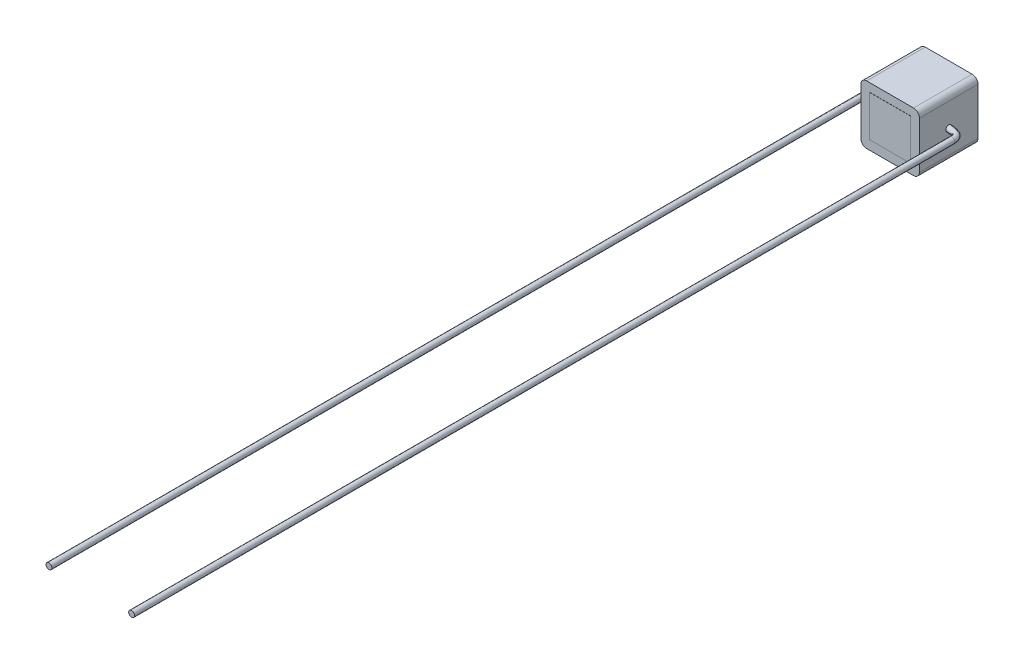
ISO-10303-21;
HEADER;
FILE_DESCRIPTION(('STEP AP214'),'2;1');
FILE_NAME('part.step','',(''),(''),'','','');
FILE_SCHEMA(('AUTOMOTIVE_DESIGN { 1 0 10303 214 1 1 1 1 }'));
ENDSEC;
DATA;
#1=APPLICATION_CONTEXT('core data for automotive mechanical design processes');
#2=APPLICATION_PROTOCOL_DEFINITION('international standard','automotive_design',2000,#1);
#3=PRODUCT_CONTEXT('',#1,'mechanical');
#4=PRODUCT('Part','Part','',(#3));
#5=PRODUCT_RELATED_PRODUCT_CATEGORY('part','',(#4));
#6=PRODUCT_DEFINITION_FORMATION('','',#4);
#7=PRODUCT_DEFINITION_CONTEXT('part definition',#1,'design');
#8=PRODUCT_DEFINITION('design','',#6,#7);
#9=PRODUCT_DEFINITION_SHAPE('','',#8);
#10=(LENGTH_UNIT() NAMED_UNIT(*) SI_UNIT(.MILLI.,.METRE.));
#11=(NAMED_UNIT(*) PLANE_ANGLE_UNIT() SI_UNIT($,.RADIAN.));
#12=(NAMED_UNIT(*) SI_UNIT($,.STERADIAN.) SOLID_ANGLE_UNIT());
#13=UNCERTAINTY_MEASURE_WITH_UNIT(LENGTH_MEASURE(1.E-05),#10,'distance_accuracy_value','');
#14=(GEOMETRIC_REPRESENTATION_CONTEXT(3) GLOBAL_UNCERTAINTY_ASSIGNED_CONTEXT((#13)) GLOBAL_UNIT_ASSIGNED_CONTEXT((#10,
#11,#12)) REPRESENTATION_CONTEXT('',''));
#15=CARTESIAN_POINT('',(0.,0.,0.));
#16=DIRECTION('',(0.,0.,1.));
#17=DIRECTION('',(1.,0.,0.));
#18=AXIS2_PLACEMENT_3D('',#15,#16,#17);
#19=CARTESIAN_POINT('',(-2.5,5.,-2.5));
#20=DIRECTION('',(1.,0.,0.));
#21=DIRECTION('',(0.,0.,-1.));
#22=AXIS2_PLACEMENT_3D('',#19,#20,#21);
#23=PLANE('',#22);
#24=DIRECTION('',(0.,-1.,0.));
#25=VECTOR('',#24,1.);
#26=CARTESIAN_POINT('',(-2.5,5.,2.5));
#27=LINE('',#26,#25);
#28=CARTESIAN_POINT('',(-2.5,4.5,2.5));
#29=VERTEX_POINT('',#28);
#30=CARTESIAN_POINT('',(-2.5,0.5,2.5));
#31=VERTEX_POINT('',#30);
#32=EDGE_CURVE('E901',#29,#31,#27,.T.);
#33=ORIENTED_EDGE('',*,*,#32,.F.);
#34=DIRECTION('',(0.,0.,1.));
#35=VECTOR('',#34,1.);
#36=CARTESIAN_POINT('',(-2.5,4.5,-2.5));
#37=LINE('',#36,#35);
#38=CARTESIAN_POINT('',(-2.5,4.5,-2.5));
#39=VERTEX_POINT('',#38);
#40=EDGE_CURVE('E15',#29,#39,#37,.F.);
#41=ORIENTED_EDGE('',*,*,#40,.T.);
#42=DIRECTION('',(0.,-1.,0.));
#43=VECTOR('',#42,1.);
#44=CARTESIAN_POINT('',(-2.5,5.,-2.5));
#45=LINE('',#44,#43);
#46=CARTESIAN_POINT('',(-2.5,0.5,-2.5));
#47=VERTEX_POINT('',#46);
#48=EDGE_CURVE('E888',#39,#47,#45,.T.);
#49=ORIENTED_EDGE('',*,*,#48,.T.);
#50=DIRECTION('',(0.,0.,1.));
#51=VECTOR('',#50,1.);
#52=CARTESIAN_POINT('',(-2.5,0.5,-2.5));
#53=LINE('',#52,#51);
#54=EDGE_CURVE('E655',#47,#31,#53,.T.);
#55=ORIENTED_EDGE('',*,*,#54,.T.);
#56=EDGE_LOOP('',(#33,#41,#49,#55));
#57=FACE_BOUND('',#56,.T.);
#58=CARTESIAN_POINT('',(-2.5,2.5,0.));
#59=DIRECTION('',(1.,0.,0.));
#60=DIRECTION('',(0.,0.,-1.));
#61=AXIS2_PLACEMENT_3D('',#58,#59,#60);
#62=CIRCLE('',#61,0.25);
#63=CARTESIAN_POINT('',(-2.5,2.5,-0.25));
#64=VERTEX_POINT('',#63);
#65=EDGE_CURVE('E904',#64,#64,#62,.F.);
#66=ORIENTED_EDGE('',*,*,#65,.F.);
#67=EDGE_LOOP('',(#66));
#68=FACE_BOUND('',#67,.T.);
#69=ADVANCED_FACE('F647',(#57,#68),#23,.F.);
#70=CARTESIAN_POINT('',(-2.5,5.,2.5));
#71=DIRECTION('',(0.,0.,-1.));
#72=DIRECTION('',(-1.,0.,0.));
#73=AXIS2_PLACEMENT_3D('',#70,#71,#72);
#74=PLANE('',#73);
#75=DIRECTION('',(1.,0.,0.));
#76=VECTOR('',#75,1.);
#77=CARTESIAN_POINT('',(-1.75,0.788215746263165,2.5));
#78=LINE('',#77,#76);
#79=CARTESIAN_POINT('',(-1.75,0.788215746263165,2.5));
#80=VERTEX_POINT('',#79);
#81=CARTESIAN_POINT('',(1.75,0.788215746263166,2.5));
#82=VERTEX_POINT('',#81);
#83=EDGE_CURVE('E765',#80,#82,#78,.T.);
#84=ORIENTED_EDGE('',*,*,#83,.F.);
#85=DIRECTION('',(0.,-1.,0.));
#86=VECTOR('',#85,1.);
#87=CARTESIAN_POINT('',(-1.75,4.28821574626317,2.5));
#88=LINE('',#87,#86);
#89=CARTESIAN_POINT('',(-1.75,4.28821574626317,2.5));
#90=VERTEX_POINT('',#89);
#91=EDGE_CURVE('E797',#90,#80,#88,.T.);
#92=ORIENTED_EDGE('',*,*,#91,.F.);
#93=DIRECTION('',(-1.,0.,0.));
#94=VECTOR('',#93,1.);
#95=CARTESIAN_POINT('',(-1.75,4.28821574626317,2.5));
#96=LINE('',#95,#94);
#97=CARTESIAN_POINT('',(1.75,4.28821574626317,2.5));
#98=VERTEX_POINT('',#97);
#99=EDGE_CURVE('E793',#98,#90,#96,.T.);
#100=ORIENTED_EDGE('',*,*,#99,.F.);
#101=DIRECTION('',(0.,1.,0.));
#102=VECTOR('',#101,1.);
#103=CARTESIAN_POINT('',(1.75,4.28821574626317,2.5));
#104=LINE('',#103,#102);
#105=EDGE_CURVE('E662',#82,#98,#104,.T.);
#106=ORIENTED_EDGE('',*,*,#105,.F.);
#107=EDGE_LOOP('',(#84,#92,#100,#106));
#108=FACE_BOUND('',#107,.T.);
#109=DIRECTION('',(1.,0.,0.));
#110=VECTOR('',#109,1.);
#111=CARTESIAN_POINT('',(-2.5,0.,2.5));
#112=LINE('',#111,#110);
#113=CARTESIAN_POINT('',(-2.,0.,2.5));
#114=VERTEX_POINT('',#113);
#115=CARTESIAN_POINT('',(2.,0.,2.5));
#116=VERTEX_POINT('',#115);
#117=EDGE_CURVE('E880',#114,#116,#112,.T.);
#118=ORIENTED_EDGE('',*,*,#117,.T.);
#119=CARTESIAN_POINT('',(2.,0.5,2.5));
#120=DIRECTION('',(0.,0.,-1.));
#121=DIRECTION('',(-1.,0.,0.));
#122=AXIS2_PLACEMENT_3D('',#119,#120,#121);
#123=CIRCLE('',#122,0.5);
#124=CARTESIAN_POINT('',(2.5,0.5,2.5));
#125=VERTEX_POINT('',#124);
#126=EDGE_CURVE('E930',#116,#125,#123,.F.);
#127=ORIENTED_EDGE('',*,*,#126,.T.);
#128=DIRECTION('',(0.,-1.,0.));
#129=VECTOR('',#128,1.);
#130=CARTESIAN_POINT('',(2.5,5.,2.5));
#131=LINE('',#130,#129);
#132=CARTESIAN_POINT('',(2.5,4.5,2.5));
#133=VERTEX_POINT('',#132);
#134=EDGE_CURVE('E898',#133,#125,#131,.T.);
#135=ORIENTED_EDGE('',*,*,#134,.F.);
#136=CARTESIAN_POINT('',(2.,4.5,2.5));
#137=DIRECTION('',(0.,0.,-1.));
#138=DIRECTION('',(-1.,0.,0.));
#139=AXIS2_PLACEMENT_3D('',#136,#137,#138);
#140=CIRCLE('',#139,0.5);
#141=CARTESIAN_POINT('',(2.,5.,2.5));
#142=VERTEX_POINT('',#141);
#143=EDGE_CURVE('E928',#133,#142,#140,.F.);
#144=ORIENTED_EDGE('',*,*,#143,.T.);
#145=DIRECTION('',(1.,0.,0.));
#146=VECTOR('',#145,1.);
#147=CARTESIAN_POINT('',(-2.5,5.,2.5));
#148=LINE('',#147,#146);
#149=CARTESIAN_POINT('',(-2.,5.,2.5));
#150=VERTEX_POINT('',#149);
#151=EDGE_CURVE('E881',#150,#142,#148,.T.);
#152=ORIENTED_EDGE('',*,*,#151,.F.);
#153=CARTESIAN_POINT('',(-2.,4.5,2.5));
#154=DIRECTION('',(0.,0.,-1.));
#155=DIRECTION('',(-1.,0.,0.));
#156=AXIS2_PLACEMENT_3D('',#153,#154,#155);
#157=CIRCLE('',#156,0.5);
#158=EDGE_CURVE('E926',#150,#29,#157,.F.);
#159=ORIENTED_EDGE('',*,*,#158,.T.);
#160=ORIENTED_EDGE('',*,*,#32,.T.);
#161=CARTESIAN_POINT('',(-2.,0.5,2.5));
#162=DIRECTION('',(0.,0.,-1.));
#163=DIRECTION('',(-1.,0.,0.));
#164=AXIS2_PLACEMENT_3D('',#161,#162,#163);
#165=CIRCLE('',#164,0.5);
#166=EDGE_CURVE('E924',#31,#114,#165,.F.);
#167=ORIENTED_EDGE('',*,*,#166,.T.);
#168=EDGE_LOOP('',(#118,#127,#135,#144,#152,#159,#160,#167));
#169=FACE_BOUND('',#168,.T.);
#170=ADVANCED_FACE('F947',(#108,#169),#74,.F.);
#171=CARTESIAN_POINT('',(2.5,5.,-2.5));
#172=DIRECTION('',(-1.,0.,0.));
#173=DIRECTION('',(0.,0.,1.));
#174=AXIS2_PLACEMENT_3D('',#171,#172,#173);
#175=PLANE('',#174);
#176=CARTESIAN_POINT('',(2.5,2.5,0.));
#177=DIRECTION('',(1.,0.,0.));
#178=DIRECTION('',(0.,0.,-1.));
#179=AXIS2_PLACEMENT_3D('',#176,#177,#178);
#180=CIRCLE('',#179,0.25);
#181=CARTESIAN_POINT('',(2.5,2.5,-0.25));
#182=VERTEX_POINT('',#181);
#183=EDGE_CURVE('E874',#182,#182,#180,.T.);
#184=ORIENTED_EDGE('',*,*,#183,.F.);
#185=EDGE_LOOP('',(#184));
#186=FACE_BOUND('',#185,.T.);
#187=ORIENTED_EDGE('',*,*,#134,.T.);
#188=DIRECTION('',(0.,0.,-1.));
#189=VECTOR('',#188,1.);
#190=CARTESIAN_POINT('',(2.5,0.5,-2.5));
#191=LINE('',#190,#189);
#192=CARTESIAN_POINT('',(2.5,0.5,-2.5));
#193=VERTEX_POINT('',#192);
#194=EDGE_CURVE('E909',#125,#193,#191,.T.);
#195=ORIENTED_EDGE('',*,*,#194,.T.);
#196=DIRECTION('',(0.,-1.,0.));
#197=VECTOR('',#196,1.);
#198=CARTESIAN_POINT('',(2.5,5.,-2.5));
#199=LINE('',#198,#197);
#200=CARTESIAN_POINT('',(2.5,4.5,-2.5));
#201=VERTEX_POINT('',#200);
#202=EDGE_CURVE('E895',#201,#193,#199,.T.);
#203=ORIENTED_EDGE('',*,*,#202,.F.);
#204=DIRECTION('',(0.,0.,-1.));
#205=VECTOR('',#204,1.);
#206=CARTESIAN_POINT('',(2.5,4.5,2.5));
#207=LINE('',#206,#205);
#208=EDGE_CURVE('E907',#201,#133,#207,.F.);
#209=ORIENTED_EDGE('',*,*,#208,.T.);
#210=EDGE_LOOP('',(#187,#195,#203,#209));
#211=FACE_BOUND('',#210,.T.);
#212=ADVANCED_FACE('F972',(#186,#211),#175,.F.);
#213=CARTESIAN_POINT('',(-2.5,5.,-2.5));
#214=DIRECTION('',(0.,0.,1.));
#215=DIRECTION('',(1.,0.,0.));
#216=AXIS2_PLACEMENT_3D('',#213,#214,#215);
#217=PLANE('',#216);
#218=DIRECTION('',(-1.,0.,0.));
#219=VECTOR('',#218,1.);
#220=CARTESIAN_POINT('',(1.75,0.75,-2.5));
#221=LINE('',#220,#219);
#222=CARTESIAN_POINT('',(1.75,0.75,-2.5));
#223=VERTEX_POINT('',#222);
#224=CARTESIAN_POINT('',(-1.75,0.75,-2.5));
#225=VERTEX_POINT('',#224);
#226=EDGE_CURVE('E813',#223,#225,#221,.T.);
#227=ORIENTED_EDGE('',*,*,#226,.F.);
#228=DIRECTION('',(0.,-1.,0.));
#229=VECTOR('',#228,1.);
#230=CARTESIAN_POINT('',(1.75,4.25,-2.5));
#231=LINE('',#230,#229);
#232=CARTESIAN_POINT('',(1.75,4.25,-2.5));
#233=VERTEX_POINT('',#232);
#234=EDGE_CURVE('E830',#233,#223,#231,.T.);
#235=ORIENTED_EDGE('',*,*,#234,.F.);
#236=DIRECTION('',(1.,0.,0.));
#237=VECTOR('',#236,1.);
#238=CARTESIAN_POINT('',(1.75,4.25,-2.5));
#239=LINE('',#238,#237);
#240=CARTESIAN_POINT('',(-1.75,4.25,-2.5));
#241=VERTEX_POINT('',#240);
#242=EDGE_CURVE('E826',#241,#233,#239,.T.);
#243=ORIENTED_EDGE('',*,*,#242,.F.);
#244=DIRECTION('',(0.,1.,0.));
#245=VECTOR('',#244,1.);
#246=CARTESIAN_POINT('',(-1.75,4.25,-2.5));
#247=LINE('',#246,#245);
#248=EDGE_CURVE('E670',#225,#241,#247,.T.);
#249=ORIENTED_EDGE('',*,*,#248,.F.);
#250=EDGE_LOOP('',(#227,#235,#243,#249));
#251=FACE_BOUND('',#250,.T.);
#252=ORIENTED_EDGE('',*,*,#202,.T.);
#253=CARTESIAN_POINT('',(2.,0.5,-2.5));
#254=DIRECTION('',(0.,0.,1.));
#255=DIRECTION('',(1.,0.,0.));
#256=AXIS2_PLACEMENT_3D('',#253,#254,#255);
#257=CIRCLE('',#256,0.5);
#258=CARTESIAN_POINT('',(2.,0.,-2.5));
#259=VERTEX_POINT('',#258);
#260=EDGE_CURVE('E918',#193,#259,#257,.F.);
#261=ORIENTED_EDGE('',*,*,#260,.T.);
#262=DIRECTION('',(-1.,0.,0.));
#263=VECTOR('',#262,1.);
#264=CARTESIAN_POINT('',(-2.5,0.,-2.5));
#265=LINE('',#264,#263);
#266=CARTESIAN_POINT('',(-2.,0.,-2.5));
#267=VERTEX_POINT('',#266);
#268=EDGE_CURVE('E885',#259,#267,#265,.T.);
#269=ORIENTED_EDGE('',*,*,#268,.T.);
#270=CARTESIAN_POINT('',(-2.,0.5,-2.5));
#271=DIRECTION('',(0.,0.,1.));
#272=DIRECTION('',(1.,0.,0.));
#273=AXIS2_PLACEMENT_3D('',#270,#271,#272);
#274=CIRCLE('',#273,0.5);
#275=EDGE_CURVE('E912',#267,#47,#274,.F.);
#276=ORIENTED_EDGE('',*,*,#275,.T.);
#277=ORIENTED_EDGE('',*,*,#48,.F.);
#278=CARTESIAN_POINT('',(-2.,4.5,-2.5));
#279=DIRECTION('',(0.,0.,1.));
#280=DIRECTION('',(1.,0.,0.));
#281=AXIS2_PLACEMENT_3D('',#278,#279,#280);
#282=CIRCLE('',#281,0.5);
#283=CARTESIAN_POINT('',(-2.,5.,-2.5));
#284=VERTEX_POINT('',#283);
#285=EDGE_CURVE('E914',#39,#284,#282,.F.);
#286=ORIENTED_EDGE('',*,*,#285,.T.);
#287=DIRECTION('',(-1.,0.,0.));
#288=VECTOR('',#287,1.);
#289=CARTESIAN_POINT('',(-2.5,5.,-2.5));
#290=LINE('',#289,#288);
#291=CARTESIAN_POINT('',(2.,5.,-2.5));
#292=VERTEX_POINT('',#291);
#293=EDGE_CURVE('E884',#292,#284,#290,.T.);
#294=ORIENTED_EDGE('',*,*,#293,.F.);
#295=CARTESIAN_POINT('',(2.,4.5,-2.5));
#296=DIRECTION('',(0.,0.,1.));
#297=DIRECTION('',(1.,0.,0.));
#298=AXIS2_PLACEMENT_3D('',#295,#296,#297);
#299=CIRCLE('',#298,0.5);
#300=EDGE_CURVE('E916',#292,#201,#299,.F.);
#301=ORIENTED_EDGE('',*,*,#300,.T.);
#302=EDGE_LOOP('',(#252,#261,#269,#276,#277,#286,#294,#301));
#303=FACE_BOUND('',#302,.T.);
#304=ADVANCED_FACE('F959',(#251,#303),#217,.F.);
#305=CARTESIAN_POINT('',(0.,5.,0.));
#306=DIRECTION('',(0.,1.,0.));
#307=DIRECTION('',(0.,0.,1.));
#308=AXIS2_PLACEMENT_3D('',#305,#306,#307);
#309=PLANE('',#308);
#310=ORIENTED_EDGE('',*,*,#151,.T.);
#311=DIRECTION('',(0.,0.,-1.));
#312=VECTOR('',#311,1.);
#313=CARTESIAN_POINT('',(2.,5.,-2.5));
#314=LINE('',#313,#312);
#315=EDGE_CURVE('E935',#142,#292,#314,.T.);
#316=ORIENTED_EDGE('',*,*,#315,.T.);
#317=ORIENTED_EDGE('',*,*,#293,.T.);
#318=DIRECTION('',(0.,0.,1.));
#319=VECTOR('',#318,1.);
#320=CARTESIAN_POINT('',(-2.,5.,2.5));
#321=LINE('',#320,#319);
#322=EDGE_CURVE('E932',#284,#150,#321,.T.);
#323=ORIENTED_EDGE('',*,*,#322,.T.);
#324=EDGE_LOOP('',(#310,#316,#317,#323));
#325=FACE_BOUND('',#324,.T.);
#326=ADVANCED_FACE('F955',(#325),#309,.T.);
#327=CARTESIAN_POINT('',(0.,0.,0.));
#328=DIRECTION('',(0.,1.,0.));
#329=DIRECTION('',(0.,0.,1.));
#330=AXIS2_PLACEMENT_3D('',#327,#328,#329);
#331=PLANE('',#330);
#332=ORIENTED_EDGE('',*,*,#268,.F.);
#333=DIRECTION('',(0.,0.,-1.));
#334=VECTOR('',#333,1.);
#335=CARTESIAN_POINT('',(2.,0.,0.));
#336=LINE('',#335,#334);
#337=EDGE_CURVE('E922',#259,#116,#336,.F.);
#338=ORIENTED_EDGE('',*,*,#337,.T.);
#339=ORIENTED_EDGE('',*,*,#117,.F.);
#340=DIRECTION('',(0.,0.,1.));
#341=VECTOR('',#340,1.);
#342=CARTESIAN_POINT('',(-2.,0.,0.));
#343=LINE('',#342,#341);
#344=EDGE_CURVE('E920',#114,#267,#343,.F.);
#345=ORIENTED_EDGE('',*,*,#344,.T.);
#346=EDGE_LOOP('',(#332,#338,#339,#345));
#347=FACE_BOUND('',#346,.T.);
#348=ADVANCED_FACE('F964',(#347),#331,.F.);
#349=CARTESIAN_POINT('',(2.5,2.5,-0.25));
#350=CARTESIAN_POINT('',(2.61032517128793,2.5,-0.2427171058597));
#351=CARTESIAN_POINT('',(2.81073621428615,2.5,-0.229487374206767));
#352=CARTESIAN_POINT('',(3.09944616648293,2.5,-0.176763451338567));
#353=CARTESIAN_POINT('',(3.30951725257793,2.5,-0.10391436418612));
#354=CARTESIAN_POINT('',(3.44547232801169,2.5,-0.0256418216858697));
#355=CARTESIAN_POINT('',(3.52920415005991,2.5,0.0412479904360616));
#356=CARTESIAN_POINT('',(3.59414239302131,2.5,0.111862987104917));
#357=CARTESIAN_POINT('',(3.66549095953961,2.5,0.21493192750837));
#358=CARTESIAN_POINT('',(3.72939373446737,2.5,0.362561949903834));
#359=CARTESIAN_POINT('',(3.76539215671446,2.5,0.553576564411401));
#360=CARTESIAN_POINT('',(3.77346652238264,2.5,0.679671891123966));
#361=CARTESIAN_POINT('',(3.77762525163319,2.5,0.744617714128271));
#362=CARTESIAN_POINT('',(2.5,3.,-0.25));
#363=CARTESIAN_POINT('',(2.61032517128793,3.,-0.2427171058597));
#364=CARTESIAN_POINT('',(2.81073621428615,3.,-0.229487374206767));
#365=CARTESIAN_POINT('',(3.09944616648293,3.,-0.176763451338567));
#366=CARTESIAN_POINT('',(3.30951725257793,3.,-0.10391436418612));
#367=CARTESIAN_POINT('',(3.44547232801169,3.,-0.02564182168587));
#368=CARTESIAN_POINT('',(3.52920415005991,3.,0.0412479904360618));
#369=CARTESIAN_POINT('',(3.59414239302131,3.,0.111862987104916));
#370=CARTESIAN_POINT('',(3.66549095953961,3.,0.21493192750837));
#371=CARTESIAN_POINT('',(3.72939373446737,3.,0.362561949903834));
#372=CARTESIAN_POINT('',(3.76539215671446,3.,0.553576564411401));
#373=CARTESIAN_POINT('',(3.77346652238264,3.,0.679671891123967));
#374=CARTESIAN_POINT('',(3.77762525163319,3.,0.744617714128271));
#375=CARTESIAN_POINT('',(2.5,3.,0.25));
#376=CARTESIAN_POINT('',(2.57516732177776,3.,0.25650810131158));
#377=CARTESIAN_POINT('',(2.71171242006315,3.,0.268330384083185));
#378=CARTESIAN_POINT('',(2.87076011421369,3.,0.296234243964267));
#379=CARTESIAN_POINT('',(2.97576764355255,3.,0.320256173702373));
#380=CARTESIAN_POINT('',(3.04984184625563,3.,0.341776369015182));
#381=CARTESIAN_POINT('',(3.10176362270132,3.,0.361152334233325));
#382=CARTESIAN_POINT('',(3.14770420651229,3.,0.385328779747776));
#383=CARTESIAN_POINT('',(3.20263101733343,3.,0.428119115980688));
#384=CARTESIAN_POINT('',(3.24945738104317,3.,0.507865780213265));
#385=CARTESIAN_POINT('',(3.26916749400132,3.,0.626995302872223));
#386=CARTESIAN_POINT('',(3.273641431928,3.,0.714239063316722));
#387=CARTESIAN_POINT('',(3.27594574873572,3.,0.759174256172635));
#388=CARTESIAN_POINT('',(2.5,2.5,0.25));
#389=CARTESIAN_POINT('',(2.57516732177776,2.5,0.25650810131158));
#390=CARTESIAN_POINT('',(2.71171242006315,2.5,0.268330384083185));
#391=CARTESIAN_POINT('',(2.87076011421369,2.5,0.296234243964268));
#392=CARTESIAN_POINT('',(2.97576764355255,2.5,0.320256173702373));
#393=CARTESIAN_POINT('',(3.04984184625562,2.5,0.341776369015182));
#394=CARTESIAN_POINT('',(3.10176362270132,2.5,0.361152334233325));
#395=CARTESIAN_POINT('',(3.14770420651229,2.5,0.385328779747775));
#396=CARTESIAN_POINT('',(3.20263101733343,2.5,0.428119115980688));
#397=CARTESIAN_POINT('',(3.24945738104317,2.5,0.507865780213265));
#398=CARTESIAN_POINT('',(3.26916749400132,2.5,0.626995302872223));
#399=CARTESIAN_POINT('',(3.273641431928,2.5,0.714239063316722));
#400=CARTESIAN_POINT('',(3.27594574873572,2.5,0.759174256172635));
#401=CARTESIAN_POINT('',(2.5,2.,0.25));
#402=CARTESIAN_POINT('',(2.57516732177776,2.,0.25650810131158));
#403=CARTESIAN_POINT('',(2.71171242006315,2.,0.268330384083185));
#404=CARTESIAN_POINT('',(2.87076011421369,2.,0.296234243964268));
#405=CARTESIAN_POINT('',(2.97576764355255,2.,0.320256173702373));
#406=CARTESIAN_POINT('',(3.04984184625563,2.,0.341776369015182));
#407=CARTESIAN_POINT('',(3.10176362270132,2.,0.361152334233325));
#408=CARTESIAN_POINT('',(3.14770420651229,2.,0.385328779747776));
#409=CARTESIAN_POINT('',(3.20263101733343,2.,0.428119115980688));
#410=CARTESIAN_POINT('',(3.24945738104317,2.,0.507865780213265));
#411=CARTESIAN_POINT('',(3.26916749400132,2.,0.626995302872223));
#412=CARTESIAN_POINT('',(3.273641431928,2.,0.714239063316722));
#413=CARTESIAN_POINT('',(3.27594574873572,2.,0.759174256172635));
#414=CARTESIAN_POINT('',(2.5,2.,-0.25));
#415=CARTESIAN_POINT('',(2.61032517128793,2.,-0.2427171058597));
#416=CARTESIAN_POINT('',(2.81073621428615,2.,-0.229487374206767));
#417=CARTESIAN_POINT('',(3.09944616648293,2.,-0.176763451338567));
#418=CARTESIAN_POINT('',(3.30951725257793,2.,-0.10391436418612));
#419=CARTESIAN_POINT('',(3.44547232801169,2.,-0.02564182168587));
#420=CARTESIAN_POINT('',(3.52920415005991,2.,0.0412479904360618));
#421=CARTESIAN_POINT('',(3.59414239302131,2.,0.111862987104916));
#422=CARTESIAN_POINT('',(3.66549095953961,2.,0.21493192750837));
#423=CARTESIAN_POINT('',(3.72939373446737,2.,0.362561949903834));
#424=CARTESIAN_POINT('',(3.76539215671446,2.,0.553576564411401));
#425=CARTESIAN_POINT('',(3.77346652238264,2.,0.679671891123967));
#426=CARTESIAN_POINT('',(3.77762525163319,2.,0.744617714128271));
#427=CARTESIAN_POINT('',(2.5,2.5,-0.25));
#428=CARTESIAN_POINT('',(2.61032517128793,2.5,-0.2427171058597));
#429=CARTESIAN_POINT('',(2.81073621428615,2.5,-0.229487374206767));
#430=CARTESIAN_POINT('',(3.09944616648293,2.5,-0.176763451338567));
#431=CARTESIAN_POINT('',(3.30951725257793,2.5,-0.10391436418612));
#432=CARTESIAN_POINT('',(3.44547232801169,2.5,-0.0256418216858697));
#433=CARTESIAN_POINT('',(3.52920415005991,2.5,0.0412479904360616));
#434=CARTESIAN_POINT('',(3.59414239302131,2.5,0.111862987104917));
#435=CARTESIAN_POINT('',(3.66549095953961,2.5,0.21493192750837));
#436=CARTESIAN_POINT('',(3.72939373446737,2.5,0.362561949903834));
#437=CARTESIAN_POINT('',(3.76539215671446,2.5,0.553576564411401));
#438=CARTESIAN_POINT('',(3.77346652238264,2.5,0.679671891123966));
#439=CARTESIAN_POINT('',(3.77762525163319,2.5,0.744617714128271));
#440=(BOUNDED_SURFACE() B_SPLINE_SURFACE(3,3,((#349,#350,#351,#352,#353,#354,#355,#356,#357,
#358,#359,#360,#361),(#362,#363,#364,#365,#366,#367,#368,#369,#370,#371,#372,#373,#374),(#375,
#376,#377,#378,#379,#380,#381,#382,#383,#384,#385,#386,#387),(#388,#389,#390,#391,#392,#393,
#394,#395,#396,#397,#398,#399,#400),(#401,#402,#403,#404,#405,#406,#407,#408,#409,#410,#411,
#412,#413),(#414,#415,#416,#417,#418,#419,#420,#421,#422,#423,#424,#425,#426),(#427,#428,#429,
#430,#431,#432,#433,#434,#435,#436,#437,#438,#439)),.UNSPECIFIED.,.T.,.F.,
.F.) B_SPLINE_SURFACE_WITH_KNOTS((4,3,4),(4,1,1,1,1,1,1,1,1,1,4),(0.,0.5,1.),(0.,
0.188467034881245,0.342359541257856,0.466752775749844,0.528710340586207,0.583960116245662,
0.633995598845497,0.680305858074827,0.783551341460871,0.888517388919216,1.),
.UNSPECIFIED.) GEOMETRIC_REPRESENTATION_ITEM() RATIONAL_B_SPLINE_SURFACE(((1.,1.,1.,1.,1.,1.,1.,
1.,1.,1.,1.,1.,1.),(0.333333333333333,0.333333333333333,0.333333333333333,0.333333333333333,
0.333333333333333,0.333333333333333,0.333333333333333,0.333333333333333,0.333333333333333,
0.333333333333333,0.333333333333333,0.333333333333333,0.333333333333333),(0.333333333333333,
0.333333333333333,0.333333333333333,0.333333333333333,0.333333333333333,0.333333333333333,
0.333333333333333,0.333333333333333,0.333333333333333,0.333333333333333,0.333333333333333,
0.333333333333333,0.333333333333333),(1.,1.,1.,1.,1.,1.,1.,1.,1.,1.,1.,1.,1.),
(0.333333333333333,0.333333333333333,0.333333333333333,0.333333333333333,0.333333333333333,
0.333333333333333,0.333333333333333,0.333333333333333,0.333333333333333,0.333333333333333,
0.333333333333333,0.333333333333333,0.333333333333333),(0.333333333333333,0.333333333333333,
0.333333333333333,0.333333333333333,0.333333333333333,0.333333333333333,0.333333333333333,
0.333333333333333,0.333333333333333,0.333333333333333,0.333333333333333,0.333333333333333,
0.333333333333333),(1.,1.,1.,1.,1.,1.,1.,1.,1.,1.,1.,1.,1.))) REPRESENTATION_ITEM('') SURFACE());
#441=CARTESIAN_POINT('',(3.77762525163319,2.5,0.744617714128271));
#442=CARTESIAN_POINT('',(3.77762525163319,2.,0.744617714128271));
#443=CARTESIAN_POINT('',(3.27594574873572,2.,0.759174256172635));
#444=CARTESIAN_POINT('',(3.27594574873572,2.5,0.759174256172635));
#445=CARTESIAN_POINT('',(3.27594574873572,3.,0.759174256172635));
#446=CARTESIAN_POINT('',(3.77762525163319,3.,0.744617714128271));
#447=CARTESIAN_POINT('',(3.77762525163319,2.5,0.744617714128271));
#448=(BOUNDED_CURVE() B_SPLINE_CURVE(3,(#441,#442,#443,#444,#445,#446,#447),.UNSPECIFIED.,.T.,
.F.) B_SPLINE_CURVE_WITH_KNOTS((4,3,4),(0.,0.5,1.),
.UNSPECIFIED.) CURVE() GEOMETRIC_REPRESENTATION_ITEM() RATIONAL_B_SPLINE_CURVE((1.,
0.333333333333333,0.333333333333333,1.,0.333333333333333,0.333333333333333,1.)) REPRESENTATION_ITEM(''));
#449=CARTESIAN_POINT('',(3.77762525163319,2.5,0.744617714128271));
#450=VERTEX_POINT('',#449);
#451=EDGE_CURVE('E858',#450,#450,#448,.T.);
#452=ORIENTED_EDGE('',*,*,#183,.T.);
#453=EDGE_LOOP('',(#452));
#454=FACE_BOUND('',#453,.T.);
#455=ORIENTED_EDGE('',*,*,#451,.T.);
#456=EDGE_LOOP('',(#455));
#457=FACE_BOUND('',#456,.T.);
#458=ADVANCED_FACE('F1001',(#454,#457),#440,.T.);
#459=CARTESIAN_POINT('',(3.27594574873573,2.5,70.7518959851505));
#460=DIRECTION('',(0.,0.,1.));
#461=DIRECTION('',(1.,0.,0.));
#462=AXIS2_PLACEMENT_3D('',#459,#460,#461);
#463=PLANE('',#462);
#464=CARTESIAN_POINT('',(3.7776252516332,2.5,70.7518959851505));
#465=CARTESIAN_POINT('',(3.7776252516332,2.,70.7518959851505));
#466=CARTESIAN_POINT('',(3.27594574873573,2.,70.7518959851505));
#467=CARTESIAN_POINT('',(3.27594574873573,2.5,70.7518959851505));
#468=CARTESIAN_POINT('',(3.27594574873573,3.,70.7518959851505));
#469=CARTESIAN_POINT('',(3.7776252516332,3.,70.7518959851505));
#470=CARTESIAN_POINT('',(3.7776252516332,2.5,70.7518959851505));
#471=(BOUNDED_CURVE() B_SPLINE_CURVE(3,(#464,#465,#466,#467,#468,#469,#470),.UNSPECIFIED.,.T.,
.F.) B_SPLINE_CURVE_WITH_KNOTS((4,3,4),(0.,0.5,1.),
.UNSPECIFIED.) CURVE() GEOMETRIC_REPRESENTATION_ITEM() RATIONAL_B_SPLINE_CURVE((1.,
0.333333333333333,0.333333333333333,1.,0.333333333333333,0.333333333333333,1.)) REPRESENTATION_ITEM(''));
#472=CARTESIAN_POINT('',(3.7776252516332,2.5,70.7518959851505));
#473=VERTEX_POINT('',#472);
#474=EDGE_CURVE('E866',#473,#473,#471,.F.);
#475=ORIENTED_EDGE('',*,*,#474,.T.);
#476=EDGE_LOOP('',(#475));
#477=FACE_BOUND('',#476,.T.);
#478=ADVANCED_FACE('F1008',(#477),#463,.T.);
#479=CARTESIAN_POINT('',(3.77762525163319,2.5,0.744617714128271));
#480=CARTESIAN_POINT('',(3.7776252516332,2.5,70.7518959851505));
#481=CARTESIAN_POINT('',(3.77762525163319,2.,0.744617714128271));
#482=CARTESIAN_POINT('',(3.7776252516332,2.,70.7518959851505));
#483=CARTESIAN_POINT('',(3.27594574873572,2.,0.759174256172635));
#484=CARTESIAN_POINT('',(3.27594574873573,2.,70.7518959851505));
#485=CARTESIAN_POINT('',(3.27594574873572,2.5,0.759174256172635));
#486=CARTESIAN_POINT('',(3.27594574873573,2.5,70.7518959851505));
#487=CARTESIAN_POINT('',(3.27594574873572,3.,0.759174256172635));
#488=CARTESIAN_POINT('',(3.27594574873573,3.,70.7518959851505));
#489=CARTESIAN_POINT('',(3.77762525163319,3.,0.744617714128271));
#490=CARTESIAN_POINT('',(3.7776252516332,3.,70.7518959851505));
#491=CARTESIAN_POINT('',(3.77762525163319,2.5,0.744617714128271));
#492=CARTESIAN_POINT('',(3.7776252516332,2.5,70.7518959851505));
#493=(BOUNDED_SURFACE() B_SPLINE_SURFACE(3,1,((#479,#480),(#481,#482),(#483,#484),(#485,#486),
(#487,#488),(#489,#490),(#491,#492)),.UNSPECIFIED.,.T.,.F.,.F.) B_SPLINE_SURFACE_WITH_KNOTS((4,
3,4),(2,2),(0.,0.5,1.),(0.,1.),
.UNSPECIFIED.) GEOMETRIC_REPRESENTATION_ITEM() RATIONAL_B_SPLINE_SURFACE(((1.,1.),
(0.333333333333333,0.333333333333333),(0.333333333333333,0.333333333333333),(1.,1.),
(0.333333333333333,0.333333333333333),(0.333333333333333,0.333333333333333),(1.,1.))) REPRESENTATION_ITEM('') SURFACE());
#494=ORIENTED_EDGE('',*,*,#451,.F.);
#495=EDGE_LOOP('',(#494));
#496=FACE_BOUND('',#495,.T.);
#497=ORIENTED_EDGE('',*,*,#474,.F.);
#498=EDGE_LOOP('',(#497));
#499=FACE_BOUND('',#498,.T.);
#500=ADVANCED_FACE('F1017',(#496,#499),#493,.F.);
#501=CARTESIAN_POINT('',(-2.5,2.5,-0.25));
#502=CARTESIAN_POINT('',(-2.61032517128793,2.5,-0.242717105859699));
#503=CARTESIAN_POINT('',(-2.81073621428615,2.5,-0.229487374206767));
#504=CARTESIAN_POINT('',(-3.09944616648293,2.5,-0.176763451338566));
#505=CARTESIAN_POINT('',(-3.30951725257793,2.5,-0.103914364186119));
#506=CARTESIAN_POINT('',(-3.44547232801169,2.5,-0.0256418216858687));
#507=CARTESIAN_POINT('',(-3.52920415005991,2.5,0.0412479904360623));
#508=CARTESIAN_POINT('',(-3.59414239302131,2.5,0.111862987104918));
#509=CARTESIAN_POINT('',(-3.66549095953961,2.5,0.214931927508371));
#510=CARTESIAN_POINT('',(-3.72939373446737,2.5,0.362561949903835));
#511=CARTESIAN_POINT('',(-3.76539215671446,2.5,0.553576564411402));
#512=CARTESIAN_POINT('',(-3.77346652238264,2.5,0.679671891123967));
#513=CARTESIAN_POINT('',(-3.77762525163319,2.5,0.744617714128272));
#514=CARTESIAN_POINT('',(-2.5,3.,-0.25));
#515=CARTESIAN_POINT('',(-2.61032517128793,3.,-0.242717105859699));
#516=CARTESIAN_POINT('',(-2.81073621428615,3.,-0.229487374206766));
#517=CARTESIAN_POINT('',(-3.09944616648293,3.,-0.176763451338566));
#518=CARTESIAN_POINT('',(-3.30951725257793,3.,-0.103914364186119));
#519=CARTESIAN_POINT('',(-3.44547232801169,3.,-0.0256418216858688));
#520=CARTESIAN_POINT('',(-3.52920415005991,3.,0.0412479904360628));
#521=CARTESIAN_POINT('',(-3.59414239302131,3.,0.111862987104917));
#522=CARTESIAN_POINT('',(-3.66549095953961,3.,0.214931927508371));
#523=CARTESIAN_POINT('',(-3.72939373446738,3.,0.362561949903834));
#524=CARTESIAN_POINT('',(-3.76539215671446,3.,0.553576564411402));
#525=CARTESIAN_POINT('',(-3.77346652238264,3.,0.679671891123967));
#526=CARTESIAN_POINT('',(-3.77762525163319,3.,0.744617714128272));
#527=CARTESIAN_POINT('',(-2.5,3.,0.25));
#528=CARTESIAN_POINT('',(-2.57516732177776,3.,0.25650810131158));
#529=CARTESIAN_POINT('',(-2.71171242006315,3.,0.268330384083186));
#530=CARTESIAN_POINT('',(-2.87076011421369,3.,0.296234243964268));
#531=CARTESIAN_POINT('',(-2.97576764355255,3.,0.320256173702372));
#532=CARTESIAN_POINT('',(-3.04984184625563,3.,0.341776369015183));
#533=CARTESIAN_POINT('',(-3.10176362270132,3.,0.361152334233325));
#534=CARTESIAN_POINT('',(-3.14770420651229,3.,0.385328779747776));
#535=CARTESIAN_POINT('',(-3.20263101733343,3.,0.428119115980689));
#536=CARTESIAN_POINT('',(-3.24945738104317,3.,0.507865780213265));
#537=CARTESIAN_POINT('',(-3.26916749400131,3.,0.626995302872223));
#538=CARTESIAN_POINT('',(-3.273641431928,3.,0.714239063316723));
#539=CARTESIAN_POINT('',(-3.27594574873572,3.,0.759174256172635));
#540=CARTESIAN_POINT('',(-2.5,2.5,0.25));
#541=CARTESIAN_POINT('',(-2.57516732177776,2.5,0.25650810131158));
#542=CARTESIAN_POINT('',(-2.71171242006315,2.5,0.268330384083186));
#543=CARTESIAN_POINT('',(-2.87076011421369,2.5,0.296234243964268));
#544=CARTESIAN_POINT('',(-2.97576764355255,2.5,0.320256173702372));
#545=CARTESIAN_POINT('',(-3.04984184625563,2.5,0.341776369015183));
#546=CARTESIAN_POINT('',(-3.10176362270132,2.5,0.361152334233325));
#547=CARTESIAN_POINT('',(-3.14770420651229,2.5,0.385328779747776));
#548=CARTESIAN_POINT('',(-3.20263101733343,2.5,0.428119115980689));
#549=CARTESIAN_POINT('',(-3.24945738104317,2.5,0.507865780213265));
#550=CARTESIAN_POINT('',(-3.26916749400132,2.5,0.626995302872224));
#551=CARTESIAN_POINT('',(-3.273641431928,2.5,0.714239063316723));
#552=CARTESIAN_POINT('',(-3.27594574873572,2.5,0.759174256172635));
#553=CARTESIAN_POINT('',(-2.5,2.,0.250000000000001));
#554=CARTESIAN_POINT('',(-2.57516732177776,2.,0.25650810131158));
#555=CARTESIAN_POINT('',(-2.71171242006315,2.,0.268330384083186));
#556=CARTESIAN_POINT('',(-2.87076011421369,2.,0.296234243964268));
#557=CARTESIAN_POINT('',(-2.97576764355255,2.,0.320256173702372));
#558=CARTESIAN_POINT('',(-3.04984184625563,2.,0.341776369015183));
#559=CARTESIAN_POINT('',(-3.10176362270132,2.,0.361152334233325));
#560=CARTESIAN_POINT('',(-3.14770420651229,2.,0.385328779747776));
#561=CARTESIAN_POINT('',(-3.20263101733343,2.,0.428119115980689));
#562=CARTESIAN_POINT('',(-3.24945738104317,2.,0.507865780213265));
#563=CARTESIAN_POINT('',(-3.26916749400131,2.,0.626995302872223));
#564=CARTESIAN_POINT('',(-3.273641431928,2.,0.714239063316723));
#565=CARTESIAN_POINT('',(-3.27594574873572,2.,0.759174256172635));
#566=CARTESIAN_POINT('',(-2.5,2.,-0.25));
#567=CARTESIAN_POINT('',(-2.61032517128793,2.,-0.242717105859699));
#568=CARTESIAN_POINT('',(-2.81073621428615,2.,-0.229487374206766));
#569=CARTESIAN_POINT('',(-3.09944616648293,2.,-0.176763451338566));
#570=CARTESIAN_POINT('',(-3.30951725257793,2.,-0.103914364186119));
#571=CARTESIAN_POINT('',(-3.44547232801169,2.,-0.0256418216858688));
#572=CARTESIAN_POINT('',(-3.52920415005991,2.,0.0412479904360628));
#573=CARTESIAN_POINT('',(-3.59414239302131,2.,0.111862987104917));
#574=CARTESIAN_POINT('',(-3.66549095953961,2.,0.214931927508371));
#575=CARTESIAN_POINT('',(-3.72939373446738,2.,0.362561949903834));
#576=CARTESIAN_POINT('',(-3.76539215671446,2.,0.553576564411402));
#577=CARTESIAN_POINT('',(-3.77346652238264,2.,0.679671891123967));
#578=CARTESIAN_POINT('',(-3.77762525163319,2.,0.744617714128272));
#579=CARTESIAN_POINT('',(-2.5,2.5,-0.25));
#580=CARTESIAN_POINT('',(-2.61032517128793,2.5,-0.242717105859699));
#581=CARTESIAN_POINT('',(-2.81073621428615,2.5,-0.229487374206767));
#582=CARTESIAN_POINT('',(-3.09944616648293,2.5,-0.176763451338566));
#583=CARTESIAN_POINT('',(-3.30951725257793,2.5,-0.103914364186119));
#584=CARTESIAN_POINT('',(-3.44547232801169,2.5,-0.0256418216858687));
#585=CARTESIAN_POINT('',(-3.52920415005991,2.5,0.0412479904360623));
#586=CARTESIAN_POINT('',(-3.59414239302131,2.5,0.111862987104918));
#587=CARTESIAN_POINT('',(-3.66549095953961,2.5,0.214931927508371));
#588=CARTESIAN_POINT('',(-3.72939373446737,2.5,0.362561949903835));
#589=CARTESIAN_POINT('',(-3.76539215671446,2.5,0.553576564411402));
#590=CARTESIAN_POINT('',(-3.77346652238264,2.5,0.679671891123967));
#591=CARTESIAN_POINT('',(-3.77762525163319,2.5,0.744617714128272));
#592=(BOUNDED_SURFACE() B_SPLINE_SURFACE(3,3,((#501,#502,#503,#504,#505,#506,#507,#508,#509,
#510,#511,#512,#513),(#514,#515,#516,#517,#518,#519,#520,#521,#522,#523,#524,#525,#526),(#527,
#528,#529,#530,#531,#532,#533,#534,#535,#536,#537,#538,#539),(#540,#541,#542,#543,#544,#545,
#546,#547,#548,#549,#550,#551,#552),(#553,#554,#555,#556,#557,#558,#559,#560,#561,#562,#563,
#564,#565),(#566,#567,#568,#569,#570,#571,#572,#573,#574,#575,#576,#577,#578),(#579,#580,#581,
#582,#583,#584,#585,#586,#587,#588,#589,#590,#591)),.UNSPECIFIED.,.T.,.F.,
.F.) B_SPLINE_SURFACE_WITH_KNOTS((4,3,4),(4,1,1,1,1,1,1,1,1,1,4),(0.,0.5,1.),(0.,
0.188467034881245,0.342359541257856,0.466752775749844,0.528710340586207,0.583960116245662,
0.633995598845497,0.680305858074827,0.783551341460871,0.888517388919216,1.),
.UNSPECIFIED.) GEOMETRIC_REPRESENTATION_ITEM() RATIONAL_B_SPLINE_SURFACE(((1.,1.,1.,1.,1.,1.,1.,
1.,1.,1.,1.,1.,1.),(0.333333333333333,0.333333333333333,0.333333333333333,0.333333333333333,
0.333333333333333,0.333333333333333,0.333333333333333,0.333333333333333,0.333333333333333,
0.333333333333333,0.333333333333333,0.333333333333333,0.333333333333333),(0.333333333333333,
0.333333333333333,0.333333333333333,0.333333333333333,0.333333333333333,0.333333333333333,
0.333333333333333,0.333333333333333,0.333333333333333,0.333333333333333,0.333333333333333,
0.333333333333333,0.333333333333333),(1.,1.,1.,1.,1.,1.,1.,1.,1.,1.,1.,1.,1.),
(0.333333333333333,0.333333333333333,0.333333333333333,0.333333333333333,0.333333333333333,
0.333333333333333,0.333333333333333,0.333333333333333,0.333333333333333,0.333333333333333,
0.333333333333333,0.333333333333333,0.333333333333333),(0.333333333333333,0.333333333333333,
0.333333333333333,0.333333333333333,0.333333333333333,0.333333333333333,0.333333333333333,
0.333333333333333,0.333333333333333,0.333333333333333,0.333333333333333,0.333333333333333,
0.333333333333333),(1.,1.,1.,1.,1.,1.,1.,1.,1.,1.,1.,1.,1.))) REPRESENTATION_ITEM('') SURFACE());
#593=CARTESIAN_POINT('',(-3.77762525163319,2.5,0.744617714128272));
#594=CARTESIAN_POINT('',(-3.77762525163319,3.,0.744617714128272));
#595=CARTESIAN_POINT('',(-3.27594574873572,3.,0.759174256172635));
#596=CARTESIAN_POINT('',(-3.27594574873572,2.5,0.759174256172635));
#597=CARTESIAN_POINT('',(-3.27594574873572,2.,0.759174256172635));
#598=CARTESIAN_POINT('',(-3.77762525163319,2.,0.744617714128272));
#599=CARTESIAN_POINT('',(-3.77762525163319,2.5,0.744617714128272));
#600=(BOUNDED_CURVE() B_SPLINE_CURVE(3,(#593,#594,#595,#596,#597,#598,#599),.UNSPECIFIED.,.T.,
.F.) B_SPLINE_CURVE_WITH_KNOTS((4,3,4),(0.,0.5,1.),
.UNSPECIFIED.) CURVE() GEOMETRIC_REPRESENTATION_ITEM() RATIONAL_B_SPLINE_CURVE((1.,
0.333333333333333,0.333333333333333,1.,0.333333333333333,0.333333333333333,1.)) REPRESENTATION_ITEM(''));
#601=CARTESIAN_POINT('',(-3.77762525163319,2.5,0.744617714128272));
#602=VERTEX_POINT('',#601);
#603=EDGE_CURVE('E850',#602,#602,#600,.F.);
#604=ORIENTED_EDGE('',*,*,#65,.T.);
#605=EDGE_LOOP('',(#604));
#606=FACE_BOUND('',#605,.T.);
#607=ORIENTED_EDGE('',*,*,#603,.F.);
#608=EDGE_LOOP('',(#607));
#609=FACE_BOUND('',#608,.T.);
#610=ADVANCED_FACE('F1023',(#606,#609),#592,.F.);
#611=CARTESIAN_POINT('',(-3.27594574873572,2.5,70.7518959851505));
#612=DIRECTION('',(0.,0.,-1.));
#613=DIRECTION('',(-1.,0.,0.));
#614=AXIS2_PLACEMENT_3D('',#611,#612,#613);
#615=PLANE('',#614);
#616=CARTESIAN_POINT('',(-3.77762525163319,2.5,70.7518959851505));
#617=CARTESIAN_POINT('',(-3.77762525163319,2.,70.7518959851505));
#618=CARTESIAN_POINT('',(-3.27594574873572,2.,70.7518959851505));
#619=CARTESIAN_POINT('',(-3.27594574873572,2.5,70.7518959851505));
#620=CARTESIAN_POINT('',(-3.27594574873572,3.,70.7518959851505));
#621=CARTESIAN_POINT('',(-3.77762525163319,3.,70.7518959851505));
#622=CARTESIAN_POINT('',(-3.77762525163319,2.5,70.7518959851505));
#623=(BOUNDED_CURVE() B_SPLINE_CURVE(3,(#616,#617,#618,#619,#620,#621,#622),.UNSPECIFIED.,.T.,
.F.) B_SPLINE_CURVE_WITH_KNOTS((4,3,4),(0.,0.5,1.),
.UNSPECIFIED.) CURVE() GEOMETRIC_REPRESENTATION_ITEM() RATIONAL_B_SPLINE_CURVE((1.,
0.333333333333333,0.333333333333333,1.,0.333333333333333,0.333333333333333,1.)) REPRESENTATION_ITEM(''));
#624=CARTESIAN_POINT('',(-3.77762525163319,2.5,70.7518959851505));
#625=VERTEX_POINT('',#624);
#626=EDGE_CURVE('E844',#625,#625,#623,.F.);
#627=ORIENTED_EDGE('',*,*,#626,.F.);
#628=EDGE_LOOP('',(#627));
#629=FACE_BOUND('',#628,.T.);
#630=ADVANCED_FACE('F1034',(#629),#615,.F.);
#631=CARTESIAN_POINT('',(-3.77762525163319,2.5,0.744617714128272));
#632=CARTESIAN_POINT('',(-3.77762525163319,2.5,70.7518959851505));
#633=CARTESIAN_POINT('',(-3.77762525163319,2.,0.744617714128272));
#634=CARTESIAN_POINT('',(-3.77762525163319,2.,70.7518959851505));
#635=CARTESIAN_POINT('',(-3.27594574873572,2.,0.759174256172635));
#636=CARTESIAN_POINT('',(-3.27594574873572,2.,70.7518959851505));
#637=CARTESIAN_POINT('',(-3.27594574873572,2.5,0.759174256172635));
#638=CARTESIAN_POINT('',(-3.27594574873572,2.5,70.7518959851505));
#639=CARTESIAN_POINT('',(-3.27594574873572,3.,0.759174256172635));
#640=CARTESIAN_POINT('',(-3.27594574873572,3.,70.7518959851505));
#641=CARTESIAN_POINT('',(-3.77762525163319,3.,0.744617714128272));
#642=CARTESIAN_POINT('',(-3.77762525163319,3.,70.7518959851505));
#643=CARTESIAN_POINT('',(-3.77762525163319,2.5,0.744617714128272));
#644=CARTESIAN_POINT('',(-3.77762525163319,2.5,70.7518959851505));
#645=(BOUNDED_SURFACE() B_SPLINE_SURFACE(3,1,((#631,#632),(#633,#634),(#635,#636),(#637,#638),
(#639,#640),(#641,#642),(#643,#644)),.UNSPECIFIED.,.T.,.F.,.F.) B_SPLINE_SURFACE_WITH_KNOTS((4,
3,4),(2,2),(0.,0.5,1.),(0.,1.),
.UNSPECIFIED.) GEOMETRIC_REPRESENTATION_ITEM() RATIONAL_B_SPLINE_SURFACE(((1.,1.),
(0.333333333333333,0.333333333333333),(0.333333333333333,0.333333333333333),(1.,1.),
(0.333333333333333,0.333333333333333),(0.333333333333333,0.333333333333333),(1.,1.))) REPRESENTATION_ITEM('') SURFACE());
#646=ORIENTED_EDGE('',*,*,#603,.T.);
#647=EDGE_LOOP('',(#646));
#648=FACE_BOUND('',#647,.T.);
#649=ORIENTED_EDGE('',*,*,#626,.T.);
#650=EDGE_LOOP('',(#649));
#651=FACE_BOUND('',#650,.T.);
#652=ADVANCED_FACE('F983',(#648,#651),#645,.T.);
#653=CARTESIAN_POINT('',(2.,0.5,-2.5));
#654=DIRECTION('',(0.,0.,-1.));
#655=DIRECTION('',(-1.,0.,0.));
#656=AXIS2_PLACEMENT_3D('',#653,#654,#655);
#657=CYLINDRICAL_SURFACE('',#656,0.5);
#658=ORIENTED_EDGE('',*,*,#126,.F.);
#659=ORIENTED_EDGE('',*,*,#337,.F.);
#660=ORIENTED_EDGE('',*,*,#260,.F.);
#661=ORIENTED_EDGE('',*,*,#194,.F.);
#662=EDGE_LOOP('',(#658,#659,#660,#661));
#663=FACE_BOUND('',#662,.T.);
#664=ADVANCED_FACE('F970',(#663),#657,.T.);
#665=CARTESIAN_POINT('',(2.,4.5,0.));
#666=DIRECTION('',(0.,0.,1.));
#667=DIRECTION('',(1.,0.,0.));
#668=AXIS2_PLACEMENT_3D('',#665,#666,#667);
#669=CYLINDRICAL_SURFACE('',#668,0.5);
#670=ORIENTED_EDGE('',*,*,#143,.F.);
#671=ORIENTED_EDGE('',*,*,#208,.F.);
#672=ORIENTED_EDGE('',*,*,#300,.F.);
#673=ORIENTED_EDGE('',*,*,#315,.F.);
#674=EDGE_LOOP('',(#670,#671,#672,#673));
#675=FACE_BOUND('',#674,.T.);
#676=ADVANCED_FACE('F976',(#675),#669,.T.);
#677=CARTESIAN_POINT('',(-2.,4.5,0.));
#678=DIRECTION('',(0.,0.,-1.));
#679=DIRECTION('',(-1.,0.,0.));
#680=AXIS2_PLACEMENT_3D('',#677,#678,#679);
#681=CYLINDRICAL_SURFACE('',#680,0.5);
#682=ORIENTED_EDGE('',*,*,#285,.F.);
#683=ORIENTED_EDGE('',*,*,#40,.F.);
#684=ORIENTED_EDGE('',*,*,#158,.F.);
#685=ORIENTED_EDGE('',*,*,#322,.F.);
#686=EDGE_LOOP('',(#682,#683,#684,#685));
#687=FACE_BOUND('',#686,.T.);
#688=ADVANCED_FACE('F953',(#687),#681,.T.);
#689=CARTESIAN_POINT('',(-2.,0.5,-2.5));
#690=DIRECTION('',(0.,0.,1.));
#691=DIRECTION('',(1.,0.,0.));
#692=AXIS2_PLACEMENT_3D('',#689,#690,#691);
#693=CYLINDRICAL_SURFACE('',#692,0.5);
#694=ORIENTED_EDGE('',*,*,#275,.F.);
#695=ORIENTED_EDGE('',*,*,#344,.F.);
#696=ORIENTED_EDGE('',*,*,#166,.F.);
#697=ORIENTED_EDGE('',*,*,#54,.F.);
#698=EDGE_LOOP('',(#694,#695,#696,#697));
#699=FACE_BOUND('',#698,.T.);
#700=ADVANCED_FACE('F649',(#699),#693,.T.);
#701=CARTESIAN_POINT('',(1.75,4.25,-2.5));
#702=DIRECTION('',(-1.,0.,0.));
#703=DIRECTION('',(0.,-1.,0.));
#704=AXIS2_PLACEMENT_3D('',#701,#702,#703);
#705=PLANE('',#704);
#706=DIRECTION('',(0.,0.,-1.));
#707=VECTOR('',#706,1.);
#708=CARTESIAN_POINT('',(1.75,4.25,-2.5));
#709=LINE('',#708,#707);
#710=CARTESIAN_POINT('',(1.75,4.25,-2.51));
#711=VERTEX_POINT('',#710);
#712=EDGE_CURVE('E842',#233,#711,#709,.T.);
#713=ORIENTED_EDGE('',*,*,#712,.F.);
#714=ORIENTED_EDGE('',*,*,#234,.T.);
#715=DIRECTION('',(0.,0.,-1.));
#716=VECTOR('',#715,1.);
#717=CARTESIAN_POINT('',(1.75,0.75,-2.5));
#718=LINE('',#717,#716);
#719=CARTESIAN_POINT('',(1.75,0.75,-2.51));
#720=VERTEX_POINT('',#719);
#721=EDGE_CURVE('E840',#223,#720,#718,.T.);
#722=ORIENTED_EDGE('',*,*,#721,.T.);
#723=DIRECTION('',(0.,1.,0.));
#724=VECTOR('',#723,1.);
#725=CARTESIAN_POINT('',(1.75,5.,-2.51));
#726=LINE('',#725,#724);
#727=EDGE_CURVE('E819',#711,#720,#726,.F.);
#728=ORIENTED_EDGE('',*,*,#727,.F.);
#729=EDGE_LOOP('',(#713,#714,#722,#728));
#730=FACE_BOUND('',#729,.T.);
#731=ADVANCED_FACE('F1060',(#730),#705,.F.);
#732=CARTESIAN_POINT('',(1.75,0.75,-2.5));
#733=DIRECTION('',(0.,1.,0.));
#734=DIRECTION('',(-1.,0.,0.));
#735=AXIS2_PLACEMENT_3D('',#732,#733,#734);
#736=PLANE('',#735);
#737=ORIENTED_EDGE('',*,*,#721,.F.);
#738=ORIENTED_EDGE('',*,*,#226,.T.);
#739=DIRECTION('',(0.,0.,-1.));
#740=VECTOR('',#739,1.);
#741=CARTESIAN_POINT('',(-1.75,0.75,-2.5));
#742=LINE('',#741,#740);
#743=CARTESIAN_POINT('',(-1.75,0.75,-2.51));
#744=VERTEX_POINT('',#743);
#745=EDGE_CURVE('E838',#225,#744,#742,.T.);
#746=ORIENTED_EDGE('',*,*,#745,.T.);
#747=DIRECTION('',(1.,0.,0.));
#748=VECTOR('',#747,1.);
#749=CARTESIAN_POINT('',(-2.5,0.75,-2.51));
#750=LINE('',#749,#748);
#751=EDGE_CURVE('E814',#720,#744,#750,.F.);
#752=ORIENTED_EDGE('',*,*,#751,.F.);
#753=EDGE_LOOP('',(#737,#738,#746,#752));
#754=FACE_BOUND('',#753,.T.);
#755=ADVANCED_FACE('F1063',(#754),#736,.F.);
#756=CARTESIAN_POINT('',(-1.75,4.25,-2.5));
#757=DIRECTION('',(1.,0.,0.));
#758=DIRECTION('',(0.,1.,0.));
#759=AXIS2_PLACEMENT_3D('',#756,#757,#758);
#760=PLANE('',#759);
#761=ORIENTED_EDGE('',*,*,#745,.F.);
#762=ORIENTED_EDGE('',*,*,#248,.T.);
#763=DIRECTION('',(0.,0.,-1.));
#764=VECTOR('',#763,1.);
#765=CARTESIAN_POINT('',(-1.75,4.25,-2.5));
#766=LINE('',#765,#764);
#767=CARTESIAN_POINT('',(-1.75,4.25,-2.51));
#768=VERTEX_POINT('',#767);
#769=EDGE_CURVE('E818',#241,#768,#766,.T.);
#770=ORIENTED_EDGE('',*,*,#769,.T.);
#771=DIRECTION('',(0.,1.,0.));
#772=VECTOR('',#771,1.);
#773=CARTESIAN_POINT('',(-1.75,5.,-2.51));
#774=LINE('',#773,#772);
#775=EDGE_CURVE('E808',#744,#768,#774,.T.);
#776=ORIENTED_EDGE('',*,*,#775,.F.);
#777=EDGE_LOOP('',(#761,#762,#770,#776));
#778=FACE_BOUND('',#777,.T.);
#779=ADVANCED_FACE('F1058',(#778),#760,.F.);
#780=CARTESIAN_POINT('',(1.75,4.25,-2.5));
#781=DIRECTION('',(0.,-1.,0.));
#782=DIRECTION('',(1.,0.,0.));
#783=AXIS2_PLACEMENT_3D('',#780,#781,#782);
#784=PLANE('',#783);
#785=ORIENTED_EDGE('',*,*,#242,.T.);
#786=ORIENTED_EDGE('',*,*,#712,.T.);
#787=DIRECTION('',(1.,0.,0.));
#788=VECTOR('',#787,1.);
#789=CARTESIAN_POINT('',(-2.5,4.25,-2.51));
#790=LINE('',#789,#788);
#791=EDGE_CURVE('E812',#768,#711,#790,.T.);
#792=ORIENTED_EDGE('',*,*,#791,.F.);
#793=ORIENTED_EDGE('',*,*,#769,.F.);
#794=EDGE_LOOP('',(#785,#786,#792,#793));
#795=FACE_BOUND('',#794,.T.);
#796=ADVANCED_FACE('F1049',(#795),#784,.F.);
#797=CARTESIAN_POINT('',(-2.5,5.,-2.51));
#798=DIRECTION('',(0.,0.,1.));
#799=DIRECTION('',(1.,0.,0.));
#800=AXIS2_PLACEMENT_3D('',#797,#798,#799);
#801=PLANE('',#800);
#802=ORIENTED_EDGE('',*,*,#775,.T.);
#803=ORIENTED_EDGE('',*,*,#791,.T.);
#804=ORIENTED_EDGE('',*,*,#727,.T.);
#805=ORIENTED_EDGE('',*,*,#751,.T.);
#806=EDGE_LOOP('',(#802,#803,#804,#805));
#807=FACE_BOUND('',#806,.T.);
#808=ADVANCED_FACE('F1057',(#807),#801,.F.);
#809=CARTESIAN_POINT('',(-1.75,4.28821574626317,2.5));
#810=DIRECTION('',(1.,0.,0.));
#811=DIRECTION('',(0.,-1.,0.));
#812=AXIS2_PLACEMENT_3D('',#809,#810,#811);
#813=PLANE('',#812);
#814=DIRECTION('',(0.,0.,1.));
#815=VECTOR('',#814,1.);
#816=CARTESIAN_POINT('',(-1.75,4.28821574626317,2.5));
#817=LINE('',#816,#815);
#818=CARTESIAN_POINT('',(-1.75,4.28821574626317,2.51));
#819=VERTEX_POINT('',#818);
#820=EDGE_CURVE('E806',#90,#819,#817,.T.);
#821=ORIENTED_EDGE('',*,*,#820,.F.);
#822=ORIENTED_EDGE('',*,*,#91,.T.);
#823=DIRECTION('',(0.,0.,1.));
#824=VECTOR('',#823,1.);
#825=CARTESIAN_POINT('',(-1.75,0.788215746263165,2.5));
#826=LINE('',#825,#824);
#827=CARTESIAN_POINT('',(-1.75,0.788215746263165,2.51));
#828=VERTEX_POINT('',#827);
#829=EDGE_CURVE('E766',#80,#828,#826,.T.);
#830=ORIENTED_EDGE('',*,*,#829,.T.);
#831=DIRECTION('',(0.,1.,0.));
#832=VECTOR('',#831,1.);
#833=CARTESIAN_POINT('',(-1.75,5.,2.51));
#834=LINE('',#833,#832);
#835=EDGE_CURVE('E781',#819,#828,#834,.F.);
#836=ORIENTED_EDGE('',*,*,#835,.F.);
#837=EDGE_LOOP('',(#821,#822,#830,#836));
#838=FACE_BOUND('',#837,.T.);
#839=ADVANCED_FACE('F1072',(#838),#813,.F.);
#840=CARTESIAN_POINT('',(-1.75,0.788215746263165,2.5));
#841=DIRECTION('',(0.,1.,0.));
#842=DIRECTION('',(1.,0.,0.));
#843=AXIS2_PLACEMENT_3D('',#840,#841,#842);
#844=PLANE('',#843);
#845=ORIENTED_EDGE('',*,*,#829,.F.);
#846=ORIENTED_EDGE('',*,*,#83,.T.);
#847=DIRECTION('',(0.,0.,1.));
#848=VECTOR('',#847,1.);
#849=CARTESIAN_POINT('',(1.75,0.788215746263166,2.5));
#850=LINE('',#849,#848);
#851=CARTESIAN_POINT('',(1.75,0.788215746263166,2.51));
#852=VERTEX_POINT('',#851);
#853=EDGE_CURVE('E759',#82,#852,#850,.T.);
#854=ORIENTED_EDGE('',*,*,#853,.T.);
#855=DIRECTION('',(-1.,0.,0.));
#856=VECTOR('',#855,1.);
#857=CARTESIAN_POINT('',(-2.5,0.788215746263165,2.51));
#858=LINE('',#857,#856);
#859=EDGE_CURVE('E763',#828,#852,#858,.F.);
#860=ORIENTED_EDGE('',*,*,#859,.F.);
#861=EDGE_LOOP('',(#845,#846,#854,#860));
#862=FACE_BOUND('',#861,.T.);
#863=ADVANCED_FACE('F761',(#862),#844,.F.);
#864=CARTESIAN_POINT('',(1.75,4.28821574626317,2.5));
#865=DIRECTION('',(-1.,0.,0.));
#866=DIRECTION('',(0.,1.,0.));
#867=AXIS2_PLACEMENT_3D('',#864,#865,#866);
#868=PLANE('',#867);
#869=ORIENTED_EDGE('',*,*,#853,.F.);
#870=ORIENTED_EDGE('',*,*,#105,.T.);
#871=DIRECTION('',(0.,0.,1.));
#872=VECTOR('',#871,1.);
#873=CARTESIAN_POINT('',(1.75,4.28821574626317,2.5));
#874=LINE('',#873,#872);
#875=CARTESIAN_POINT('',(1.75,4.28821574626317,2.51));
#876=VERTEX_POINT('',#875);
#877=EDGE_CURVE('E767',#98,#876,#874,.T.);
#878=ORIENTED_EDGE('',*,*,#877,.T.);
#879=DIRECTION('',(0.,1.,0.));
#880=VECTOR('',#879,1.);
#881=CARTESIAN_POINT('',(1.75,5.,2.51));
#882=LINE('',#881,#880);
#883=EDGE_CURVE('E770',#852,#876,#882,.T.);
#884=ORIENTED_EDGE('',*,*,#883,.F.);
#885=EDGE_LOOP('',(#869,#870,#878,#884));
#886=FACE_BOUND('',#885,.T.);
#887=ADVANCED_FACE('F771',(#886),#868,.F.);
#888=CARTESIAN_POINT('',(-1.75,4.28821574626317,2.5));
#889=DIRECTION('',(0.,-1.,0.));
#890=DIRECTION('',(-1.,0.,0.));
#891=AXIS2_PLACEMENT_3D('',#888,#889,#890);
#892=PLANE('',#891);
#893=ORIENTED_EDGE('',*,*,#99,.T.);
#894=ORIENTED_EDGE('',*,*,#820,.T.);
#895=DIRECTION('',(-1.,0.,0.));
#896=VECTOR('',#895,1.);
#897=CARTESIAN_POINT('',(-2.5,4.28821574626317,2.51));
#898=LINE('',#897,#896);
#899=EDGE_CURVE('E776',#876,#819,#898,.T.);
#900=ORIENTED_EDGE('',*,*,#899,.F.);
#901=ORIENTED_EDGE('',*,*,#877,.F.);
#902=EDGE_LOOP('',(#893,#894,#900,#901));
#903=FACE_BOUND('',#902,.T.);
#904=ADVANCED_FACE('F1074',(#903),#892,.F.);
#905=CARTESIAN_POINT('',(-2.5,5.,2.51));
#906=DIRECTION('',(0.,0.,-1.));
#907=DIRECTION('',(-1.,0.,0.));
#908=AXIS2_PLACEMENT_3D('',#905,#906,#907);
#909=PLANE('',#908);
#910=ORIENTED_EDGE('',*,*,#883,.T.);
#911=ORIENTED_EDGE('',*,*,#899,.T.);
#912=ORIENTED_EDGE('',*,*,#835,.T.);
#913=ORIENTED_EDGE('',*,*,#859,.T.);
#914=EDGE_LOOP('',(#910,#911,#912,#913));
#915=FACE_BOUND('',#914,.T.);
#916=ADVANCED_FACE('F779',(#915),#909,.F.);
#917=CLOSED_SHELL('',(#69,#170,#212,#304,#326,#348,#458,#478,#500,#610,#630,#652,#664,#676,#688,
#700,#731,#755,#779,#796,#808,#839,#863,#887,#904,#916));
#918=MANIFOLD_SOLID_BREP('B2',#917);
#919=ADVANCED_BREP_SHAPE_REPRESENTATION('',(#18,#918),#14);
#920=SHAPE_DEFINITION_REPRESENTATION(#9,#919);
ENDSEC;
END-ISO-10303-21;
